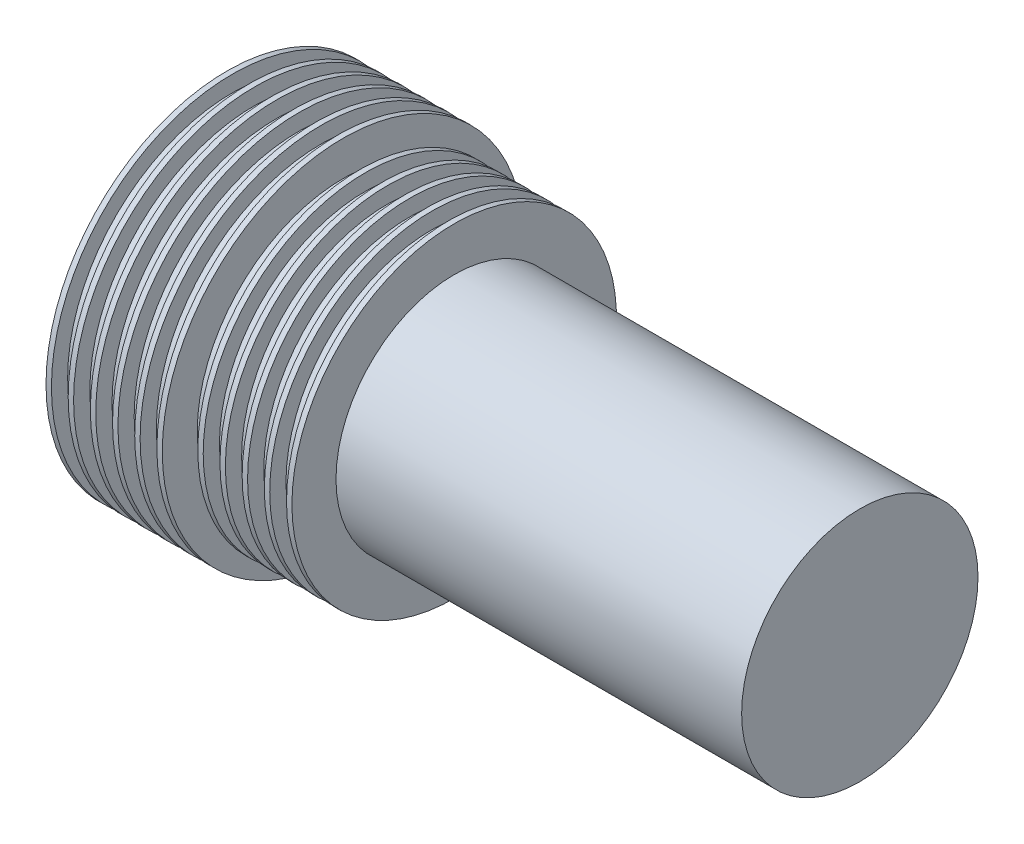
ISO-10303-21;
HEADER;
FILE_DESCRIPTION(('STEP AP214'),'2;1');
FILE_NAME('part.step','',(''),(''),'','','');
FILE_SCHEMA(('AUTOMOTIVE_DESIGN { 1 0 10303 214 1 1 1 1 }'));
ENDSEC;
DATA;
#1=APPLICATION_CONTEXT('core data for automotive mechanical design processes');
#2=APPLICATION_PROTOCOL_DEFINITION('international standard','automotive_design',2000,#1);
#3=PRODUCT_CONTEXT('',#1,'mechanical');
#4=PRODUCT('Part','Part','',(#3));
#5=PRODUCT_RELATED_PRODUCT_CATEGORY('part','',(#4));
#6=PRODUCT_DEFINITION_FORMATION('','',#4);
#7=PRODUCT_DEFINITION_CONTEXT('part definition',#1,'design');
#8=PRODUCT_DEFINITION('design','',#6,#7);
#9=PRODUCT_DEFINITION_SHAPE('','',#8);
#10=(LENGTH_UNIT() NAMED_UNIT(*) SI_UNIT(.MILLI.,.METRE.));
#11=(NAMED_UNIT(*) PLANE_ANGLE_UNIT() SI_UNIT($,.RADIAN.));
#12=(NAMED_UNIT(*) SI_UNIT($,.STERADIAN.) SOLID_ANGLE_UNIT());
#13=UNCERTAINTY_MEASURE_WITH_UNIT(LENGTH_MEASURE(1.E-05),#10,'distance_accuracy_value','');
#14=(GEOMETRIC_REPRESENTATION_CONTEXT(3) GLOBAL_UNCERTAINTY_ASSIGNED_CONTEXT((#13)) GLOBAL_UNIT_ASSIGNED_CONTEXT((#10,
#11,#12)) REPRESENTATION_CONTEXT('',''));
#15=CARTESIAN_POINT('',(0.,0.,0.));
#16=DIRECTION('',(0.,0.,1.));
#17=DIRECTION('',(1.,0.,0.));
#18=AXIS2_PLACEMENT_3D('',#15,#16,#17);
#19=CARTESIAN_POINT('',(0.,8.500000018,0.));
#20=DIRECTION('',(1.,0.,0.));
#21=DIRECTION('',(0.,0.,-1.));
#22=AXIS2_PLACEMENT_3D('',#19,#20,#21);
#23=PLANE('',#22);
#24=CARTESIAN_POINT('',(0.,0.,0.));
#25=DIRECTION('',(-1.,0.,0.));
#26=DIRECTION('',(0.,0.,1.));
#27=AXIS2_PLACEMENT_3D('',#24,#25,#26);
#28=CIRCLE('',#27,8.500000018);
#29=CARTESIAN_POINT('',(0.,0.,8.500000018));
#30=VERTEX_POINT('',#29);
#31=EDGE_CURVE('E183',#30,#30,#28,.T.);
#32=ORIENTED_EDGE('',*,*,#31,.T.);
#33=EDGE_LOOP('',(#32));
#34=FACE_BOUND('',#33,.T.);
#35=ADVANCED_FACE('F47',(#34),#23,.F.);
#36=CARTESIAN_POINT('',(29.718,0.,0.));
#37=DIRECTION('',(-1.,0.,0.));
#38=DIRECTION('',(0.,0.,1.));
#39=AXIS2_PLACEMENT_3D('',#36,#37,#38);
#40=PLANE('',#39);
#41=CARTESIAN_POINT('',(29.718,0.,0.));
#42=DIRECTION('',(-1.,0.,0.));
#43=DIRECTION('',(0.,0.,1.));
#44=AXIS2_PLACEMENT_3D('',#41,#42,#43);
#45=CIRCLE('',#44,5.5499);
#46=CARTESIAN_POINT('',(29.718,0.,5.5499));
#47=VERTEX_POINT('',#46);
#48=EDGE_CURVE('E10',#47,#47,#45,.T.);
#49=ORIENTED_EDGE('',*,*,#48,.F.);
#50=EDGE_LOOP('',(#49));
#51=FACE_BOUND('',#50,.T.);
#52=ADVANCED_FACE('F442',(#51),#40,.F.);
#53=CARTESIAN_POINT('',(0.,0.,0.));
#54=DIRECTION('',(-1.,0.,0.));
#55=DIRECTION('',(0.,0.,1.));
#56=AXIS2_PLACEMENT_3D('',#53,#54,#55);
#57=CYLINDRICAL_SURFACE('',#56,5.5499);
#58=CARTESIAN_POINT('',(10.668,0.,0.));
#59=DIRECTION('',(-1.,0.,0.));
#60=DIRECTION('',(0.,0.,1.));
#61=AXIS2_PLACEMENT_3D('',#58,#59,#60);
#62=CIRCLE('',#61,5.5499);
#63=CARTESIAN_POINT('',(10.668,0.,5.5499));
#64=VERTEX_POINT('',#63);
#65=EDGE_CURVE('E53',#64,#64,#62,.T.);
#66=ORIENTED_EDGE('',*,*,#65,.F.);
#67=EDGE_LOOP('',(#66));
#68=FACE_BOUND('',#67,.T.);
#69=ORIENTED_EDGE('',*,*,#48,.T.);
#70=EDGE_LOOP('',(#69));
#71=FACE_BOUND('',#70,.T.);
#72=ADVANCED_FACE('F436',(#68,#71),#57,.T.);
#73=CARTESIAN_POINT('',(10.668,7.62,0.));
#74=DIRECTION('',(-1.,0.,0.));
#75=DIRECTION('',(0.,0.,1.));
#76=AXIS2_PLACEMENT_3D('',#73,#74,#75);
#77=PLANE('',#76);
#78=CARTESIAN_POINT('',(10.668,0.,0.));
#79=DIRECTION('',(-1.,0.,0.));
#80=DIRECTION('',(0.,0.,1.));
#81=AXIS2_PLACEMENT_3D('',#78,#79,#80);
#82=CIRCLE('',#81,7.62);
#83=CARTESIAN_POINT('',(10.668,0.,7.62));
#84=VERTEX_POINT('',#83);
#85=EDGE_CURVE('E57',#84,#84,#82,.T.);
#86=ORIENTED_EDGE('',*,*,#85,.F.);
#87=EDGE_LOOP('',(#86));
#88=FACE_BOUND('',#87,.T.);
#89=ORIENTED_EDGE('',*,*,#65,.T.);
#90=EDGE_LOOP('',(#89));
#91=FACE_BOUND('',#90,.T.);
#92=ADVANCED_FACE('F431',(#88,#91),#77,.F.);
#93=CARTESIAN_POINT('',(0.,0.,0.));
#94=DIRECTION('',(-1.,0.,0.));
#95=DIRECTION('',(0.,0.,1.));
#96=AXIS2_PLACEMENT_3D('',#93,#94,#95);
#97=CYLINDRICAL_SURFACE('',#96,7.62);
#98=CARTESIAN_POINT('',(10.414,0.,0.));
#99=DIRECTION('',(-1.,0.,0.));
#100=DIRECTION('',(0.,0.,1.));
#101=AXIS2_PLACEMENT_3D('',#98,#99,#100);
#102=CIRCLE('',#101,7.62);
#103=CARTESIAN_POINT('',(10.414,0.,7.62));
#104=VERTEX_POINT('',#103);
#105=EDGE_CURVE('E61',#104,#104,#102,.T.);
#106=ORIENTED_EDGE('',*,*,#105,.F.);
#107=EDGE_LOOP('',(#106));
#108=FACE_BOUND('',#107,.T.);
#109=ORIENTED_EDGE('',*,*,#85,.T.);
#110=EDGE_LOOP('',(#109));
#111=FACE_BOUND('',#110,.T.);
#112=ADVANCED_FACE('F425',(#108,#111),#97,.T.);
#113=CARTESIAN_POINT('',(10.414,6.858,0.));
#114=DIRECTION('',(1.,0.,0.));
#115=DIRECTION('',(0.,0.,-1.));
#116=AXIS2_PLACEMENT_3D('',#113,#114,#115);
#117=PLANE('',#116);
#118=CARTESIAN_POINT('',(10.414,0.,0.));
#119=DIRECTION('',(-1.,0.,0.));
#120=DIRECTION('',(0.,0.,1.));
#121=AXIS2_PLACEMENT_3D('',#118,#119,#120);
#122=CIRCLE('',#121,6.858);
#123=CARTESIAN_POINT('',(10.414,0.,6.858));
#124=VERTEX_POINT('',#123);
#125=EDGE_CURVE('E66',#124,#124,#122,.T.);
#126=ORIENTED_EDGE('',*,*,#125,.F.);
#127=EDGE_LOOP('',(#126));
#128=FACE_BOUND('',#127,.T.);
#129=ORIENTED_EDGE('',*,*,#105,.T.);
#130=EDGE_LOOP('',(#129));
#131=FACE_BOUND('',#130,.T.);
#132=ADVANCED_FACE('F419',(#128,#131),#117,.F.);
#133=CARTESIAN_POINT('',(0.,0.,0.));
#134=DIRECTION('',(-1.,0.,0.));
#135=DIRECTION('',(0.,0.,1.));
#136=AXIS2_PLACEMENT_3D('',#133,#134,#135);
#137=CYLINDRICAL_SURFACE('',#136,6.858);
#138=CARTESIAN_POINT('',(9.6266,0.,0.));
#139=DIRECTION('',(-1.,0.,0.));
#140=DIRECTION('',(0.,0.,1.));
#141=AXIS2_PLACEMENT_3D('',#138,#139,#140);
#142=CIRCLE('',#141,6.858);
#143=CARTESIAN_POINT('',(9.6266,0.,6.858));
#144=VERTEX_POINT('',#143);
#145=EDGE_CURVE('E69',#144,#144,#142,.T.);
#146=ORIENTED_EDGE('',*,*,#145,.F.);
#147=EDGE_LOOP('',(#146));
#148=FACE_BOUND('',#147,.T.);
#149=ORIENTED_EDGE('',*,*,#125,.T.);
#150=EDGE_LOOP('',(#149));
#151=FACE_BOUND('',#150,.T.);
#152=ADVANCED_FACE('F413',(#148,#151),#137,.T.);
#153=CARTESIAN_POINT('',(9.6266,7.62,0.));
#154=DIRECTION('',(-1.,0.,0.));
#155=DIRECTION('',(0.,0.,1.));
#156=AXIS2_PLACEMENT_3D('',#153,#154,#155);
#157=PLANE('',#156);
#158=CARTESIAN_POINT('',(9.6266,0.,0.));
#159=DIRECTION('',(-1.,0.,0.));
#160=DIRECTION('',(0.,0.,1.));
#161=AXIS2_PLACEMENT_3D('',#158,#159,#160);
#162=CIRCLE('',#161,7.62);
#163=CARTESIAN_POINT('',(9.6266,0.,7.62));
#164=VERTEX_POINT('',#163);
#165=EDGE_CURVE('E72',#164,#164,#162,.T.);
#166=ORIENTED_EDGE('',*,*,#165,.F.);
#167=EDGE_LOOP('',(#166));
#168=FACE_BOUND('',#167,.T.);
#169=ORIENTED_EDGE('',*,*,#145,.T.);
#170=EDGE_LOOP('',(#169));
#171=FACE_BOUND('',#170,.T.);
#172=ADVANCED_FACE('F407',(#168,#171),#157,.F.);
#173=CARTESIAN_POINT('',(0.,0.,0.));
#174=DIRECTION('',(-1.,0.,0.));
#175=DIRECTION('',(0.,0.,1.));
#176=AXIS2_PLACEMENT_3D('',#173,#174,#175);
#177=CYLINDRICAL_SURFACE('',#176,7.62);
#178=CARTESIAN_POINT('',(9.3726,0.,0.));
#179=DIRECTION('',(-1.,0.,0.));
#180=DIRECTION('',(0.,0.,1.));
#181=AXIS2_PLACEMENT_3D('',#178,#179,#180);
#182=CIRCLE('',#181,7.62);
#183=CARTESIAN_POINT('',(9.3726,0.,7.62));
#184=VERTEX_POINT('',#183);
#185=EDGE_CURVE('E75',#184,#184,#182,.T.);
#186=ORIENTED_EDGE('',*,*,#185,.F.);
#187=EDGE_LOOP('',(#186));
#188=FACE_BOUND('',#187,.T.);
#189=ORIENTED_EDGE('',*,*,#165,.T.);
#190=EDGE_LOOP('',(#189));
#191=FACE_BOUND('',#190,.T.);
#192=ADVANCED_FACE('F401',(#188,#191),#177,.T.);
#193=CARTESIAN_POINT('',(9.3726,6.858,0.));
#194=DIRECTION('',(1.,0.,0.));
#195=DIRECTION('',(0.,0.,-1.));
#196=AXIS2_PLACEMENT_3D('',#193,#194,#195);
#197=PLANE('',#196);
#198=CARTESIAN_POINT('',(9.3726,0.,0.));
#199=DIRECTION('',(-1.,0.,0.));
#200=DIRECTION('',(0.,0.,1.));
#201=AXIS2_PLACEMENT_3D('',#198,#199,#200);
#202=CIRCLE('',#201,6.858);
#203=CARTESIAN_POINT('',(9.3726,0.,6.858));
#204=VERTEX_POINT('',#203);
#205=EDGE_CURVE('E78',#204,#204,#202,.T.);
#206=ORIENTED_EDGE('',*,*,#205,.F.);
#207=EDGE_LOOP('',(#206));
#208=FACE_BOUND('',#207,.T.);
#209=ORIENTED_EDGE('',*,*,#185,.T.);
#210=EDGE_LOOP('',(#209));
#211=FACE_BOUND('',#210,.T.);
#212=ADVANCED_FACE('F395',(#208,#211),#197,.F.);
#213=CARTESIAN_POINT('',(0.,0.,0.));
#214=DIRECTION('',(-1.,0.,0.));
#215=DIRECTION('',(0.,0.,1.));
#216=AXIS2_PLACEMENT_3D('',#213,#214,#215);
#217=CYLINDRICAL_SURFACE('',#216,6.858);
#218=CARTESIAN_POINT('',(8.5852,0.,0.));
#219=DIRECTION('',(-1.,0.,0.));
#220=DIRECTION('',(0.,0.,1.));
#221=AXIS2_PLACEMENT_3D('',#218,#219,#220);
#222=CIRCLE('',#221,6.858);
#223=CARTESIAN_POINT('',(8.5852,0.,6.858));
#224=VERTEX_POINT('',#223);
#225=EDGE_CURVE('E81',#224,#224,#222,.T.);
#226=ORIENTED_EDGE('',*,*,#225,.F.);
#227=EDGE_LOOP('',(#226));
#228=FACE_BOUND('',#227,.T.);
#229=ORIENTED_EDGE('',*,*,#205,.T.);
#230=EDGE_LOOP('',(#229));
#231=FACE_BOUND('',#230,.T.);
#232=ADVANCED_FACE('F389',(#228,#231),#217,.T.);
#233=CARTESIAN_POINT('',(8.5852,7.62,0.));
#234=DIRECTION('',(-1.,0.,0.));
#235=DIRECTION('',(0.,0.,1.));
#236=AXIS2_PLACEMENT_3D('',#233,#234,#235);
#237=PLANE('',#236);
#238=CARTESIAN_POINT('',(8.5852,0.,0.));
#239=DIRECTION('',(-1.,0.,0.));
#240=DIRECTION('',(0.,0.,1.));
#241=AXIS2_PLACEMENT_3D('',#238,#239,#240);
#242=CIRCLE('',#241,7.62);
#243=CARTESIAN_POINT('',(8.5852,0.,7.62));
#244=VERTEX_POINT('',#243);
#245=EDGE_CURVE('E84',#244,#244,#242,.T.);
#246=ORIENTED_EDGE('',*,*,#245,.F.);
#247=EDGE_LOOP('',(#246));
#248=FACE_BOUND('',#247,.T.);
#249=ORIENTED_EDGE('',*,*,#225,.T.);
#250=EDGE_LOOP('',(#249));
#251=FACE_BOUND('',#250,.T.);
#252=ADVANCED_FACE('F383',(#248,#251),#237,.F.);
#253=CARTESIAN_POINT('',(0.,0.,0.));
#254=DIRECTION('',(-1.,0.,0.));
#255=DIRECTION('',(0.,0.,1.));
#256=AXIS2_PLACEMENT_3D('',#253,#254,#255);
#257=CYLINDRICAL_SURFACE('',#256,7.62);
#258=CARTESIAN_POINT('',(8.3312,0.,0.));
#259=DIRECTION('',(-1.,0.,0.));
#260=DIRECTION('',(0.,0.,1.));
#261=AXIS2_PLACEMENT_3D('',#258,#259,#260);
#262=CIRCLE('',#261,7.62);
#263=CARTESIAN_POINT('',(8.3312,0.,7.62));
#264=VERTEX_POINT('',#263);
#265=EDGE_CURVE('E87',#264,#264,#262,.T.);
#266=ORIENTED_EDGE('',*,*,#265,.F.);
#267=EDGE_LOOP('',(#266));
#268=FACE_BOUND('',#267,.T.);
#269=ORIENTED_EDGE('',*,*,#245,.T.);
#270=EDGE_LOOP('',(#269));
#271=FACE_BOUND('',#270,.T.);
#272=ADVANCED_FACE('F377',(#268,#271),#257,.T.);
#273=CARTESIAN_POINT('',(8.3312,6.858,0.));
#274=DIRECTION('',(1.,0.,0.));
#275=DIRECTION('',(0.,0.,-1.));
#276=AXIS2_PLACEMENT_3D('',#273,#274,#275);
#277=PLANE('',#276);
#278=CARTESIAN_POINT('',(8.3312,0.,0.));
#279=DIRECTION('',(-1.,0.,0.));
#280=DIRECTION('',(0.,0.,1.));
#281=AXIS2_PLACEMENT_3D('',#278,#279,#280);
#282=CIRCLE('',#281,6.858);
#283=CARTESIAN_POINT('',(8.3312,0.,6.858));
#284=VERTEX_POINT('',#283);
#285=EDGE_CURVE('E90',#284,#284,#282,.T.);
#286=ORIENTED_EDGE('',*,*,#285,.F.);
#287=EDGE_LOOP('',(#286));
#288=FACE_BOUND('',#287,.T.);
#289=ORIENTED_EDGE('',*,*,#265,.T.);
#290=EDGE_LOOP('',(#289));
#291=FACE_BOUND('',#290,.T.);
#292=ADVANCED_FACE('F371',(#288,#291),#277,.F.);
#293=CARTESIAN_POINT('',(0.,0.,0.));
#294=DIRECTION('',(-1.,0.,0.));
#295=DIRECTION('',(0.,0.,1.));
#296=AXIS2_PLACEMENT_3D('',#293,#294,#295);
#297=CYLINDRICAL_SURFACE('',#296,6.858);
#298=CARTESIAN_POINT('',(7.5438,0.,0.));
#299=DIRECTION('',(-1.,0.,0.));
#300=DIRECTION('',(0.,0.,1.));
#301=AXIS2_PLACEMENT_3D('',#298,#299,#300);
#302=CIRCLE('',#301,6.858);
#303=CARTESIAN_POINT('',(7.5438,0.,6.858));
#304=VERTEX_POINT('',#303);
#305=EDGE_CURVE('E93',#304,#304,#302,.T.);
#306=ORIENTED_EDGE('',*,*,#305,.F.);
#307=EDGE_LOOP('',(#306));
#308=FACE_BOUND('',#307,.T.);
#309=ORIENTED_EDGE('',*,*,#285,.T.);
#310=EDGE_LOOP('',(#309));
#311=FACE_BOUND('',#310,.T.);
#312=ADVANCED_FACE('F365',(#308,#311),#297,.T.);
#313=CARTESIAN_POINT('',(7.5438,7.62,0.));
#314=DIRECTION('',(-1.,0.,0.));
#315=DIRECTION('',(0.,0.,1.));
#316=AXIS2_PLACEMENT_3D('',#313,#314,#315);
#317=PLANE('',#316);
#318=CARTESIAN_POINT('',(7.5438,0.,0.));
#319=DIRECTION('',(-1.,0.,0.));
#320=DIRECTION('',(0.,0.,1.));
#321=AXIS2_PLACEMENT_3D('',#318,#319,#320);
#322=CIRCLE('',#321,7.62);
#323=CARTESIAN_POINT('',(7.5438,0.,7.62));
#324=VERTEX_POINT('',#323);
#325=EDGE_CURVE('E96',#324,#324,#322,.T.);
#326=ORIENTED_EDGE('',*,*,#325,.F.);
#327=EDGE_LOOP('',(#326));
#328=FACE_BOUND('',#327,.T.);
#329=ORIENTED_EDGE('',*,*,#305,.T.);
#330=EDGE_LOOP('',(#329));
#331=FACE_BOUND('',#330,.T.);
#332=ADVANCED_FACE('F359',(#328,#331),#317,.F.);
#333=CARTESIAN_POINT('',(0.,0.,0.));
#334=DIRECTION('',(-1.,0.,0.));
#335=DIRECTION('',(0.,0.,1.));
#336=AXIS2_PLACEMENT_3D('',#333,#334,#335);
#337=CYLINDRICAL_SURFACE('',#336,7.62);
#338=CARTESIAN_POINT('',(7.2898,0.,0.));
#339=DIRECTION('',(-1.,0.,0.));
#340=DIRECTION('',(0.,0.,1.));
#341=AXIS2_PLACEMENT_3D('',#338,#339,#340);
#342=CIRCLE('',#341,7.62);
#343=CARTESIAN_POINT('',(7.2898,0.,7.62));
#344=VERTEX_POINT('',#343);
#345=EDGE_CURVE('E99',#344,#344,#342,.T.);
#346=ORIENTED_EDGE('',*,*,#345,.F.);
#347=EDGE_LOOP('',(#346));
#348=FACE_BOUND('',#347,.T.);
#349=ORIENTED_EDGE('',*,*,#325,.T.);
#350=EDGE_LOOP('',(#349));
#351=FACE_BOUND('',#350,.T.);
#352=ADVANCED_FACE('F353',(#348,#351),#337,.T.);
#353=CARTESIAN_POINT('',(7.2898,6.858,0.));
#354=DIRECTION('',(1.,0.,0.));
#355=DIRECTION('',(0.,0.,-1.));
#356=AXIS2_PLACEMENT_3D('',#353,#354,#355);
#357=PLANE('',#356);
#358=CARTESIAN_POINT('',(7.2898,0.,0.));
#359=DIRECTION('',(-1.,0.,0.));
#360=DIRECTION('',(0.,0.,1.));
#361=AXIS2_PLACEMENT_3D('',#358,#359,#360);
#362=CIRCLE('',#361,6.858);
#363=CARTESIAN_POINT('',(7.2898,0.,6.858));
#364=VERTEX_POINT('',#363);
#365=EDGE_CURVE('E102',#364,#364,#362,.T.);
#366=ORIENTED_EDGE('',*,*,#365,.F.);
#367=EDGE_LOOP('',(#366));
#368=FACE_BOUND('',#367,.T.);
#369=ORIENTED_EDGE('',*,*,#345,.T.);
#370=EDGE_LOOP('',(#369));
#371=FACE_BOUND('',#370,.T.);
#372=ADVANCED_FACE('F347',(#368,#371),#357,.F.);
#373=CARTESIAN_POINT('',(0.,0.,0.));
#374=DIRECTION('',(-1.,0.,0.));
#375=DIRECTION('',(0.,0.,1.));
#376=AXIS2_PLACEMENT_3D('',#373,#374,#375);
#377=CYLINDRICAL_SURFACE('',#376,6.858);
#378=CARTESIAN_POINT('',(6.5024,0.,0.));
#379=DIRECTION('',(-1.,0.,0.));
#380=DIRECTION('',(0.,0.,1.));
#381=AXIS2_PLACEMENT_3D('',#378,#379,#380);
#382=CIRCLE('',#381,6.858);
#383=CARTESIAN_POINT('',(6.5024,0.,6.858));
#384=VERTEX_POINT('',#383);
#385=EDGE_CURVE('E105',#384,#384,#382,.T.);
#386=ORIENTED_EDGE('',*,*,#385,.F.);
#387=EDGE_LOOP('',(#386));
#388=FACE_BOUND('',#387,.T.);
#389=ORIENTED_EDGE('',*,*,#365,.T.);
#390=EDGE_LOOP('',(#389));
#391=FACE_BOUND('',#390,.T.);
#392=ADVANCED_FACE('F341',(#388,#391),#377,.T.);
#393=CARTESIAN_POINT('',(6.5024,7.62,0.));
#394=DIRECTION('',(-1.,0.,0.));
#395=DIRECTION('',(0.,0.,1.));
#396=AXIS2_PLACEMENT_3D('',#393,#394,#395);
#397=PLANE('',#396);
#398=CARTESIAN_POINT('',(6.5024,0.,0.));
#399=DIRECTION('',(-1.,0.,0.));
#400=DIRECTION('',(0.,0.,1.));
#401=AXIS2_PLACEMENT_3D('',#398,#399,#400);
#402=CIRCLE('',#401,7.62);
#403=CARTESIAN_POINT('',(6.5024,0.,7.62));
#404=VERTEX_POINT('',#403);
#405=EDGE_CURVE('E108',#404,#404,#402,.T.);
#406=ORIENTED_EDGE('',*,*,#405,.F.);
#407=EDGE_LOOP('',(#406));
#408=FACE_BOUND('',#407,.T.);
#409=ORIENTED_EDGE('',*,*,#385,.T.);
#410=EDGE_LOOP('',(#409));
#411=FACE_BOUND('',#410,.T.);
#412=ADVANCED_FACE('F335',(#408,#411),#397,.F.);
#413=CARTESIAN_POINT('',(0.,0.,0.));
#414=DIRECTION('',(-1.,0.,0.));
#415=DIRECTION('',(0.,0.,1.));
#416=AXIS2_PLACEMENT_3D('',#413,#414,#415);
#417=CYLINDRICAL_SURFACE('',#416,7.62);
#418=CARTESIAN_POINT('',(6.2484,0.,0.));
#419=DIRECTION('',(-1.,0.,0.));
#420=DIRECTION('',(0.,0.,1.));
#421=AXIS2_PLACEMENT_3D('',#418,#419,#420);
#422=CIRCLE('',#421,7.62);
#423=CARTESIAN_POINT('',(6.2484,0.,7.62));
#424=VERTEX_POINT('',#423);
#425=EDGE_CURVE('E111',#424,#424,#422,.T.);
#426=ORIENTED_EDGE('',*,*,#425,.F.);
#427=EDGE_LOOP('',(#426));
#428=FACE_BOUND('',#427,.T.);
#429=ORIENTED_EDGE('',*,*,#405,.T.);
#430=EDGE_LOOP('',(#429));
#431=FACE_BOUND('',#430,.T.);
#432=ADVANCED_FACE('F329',(#428,#431),#417,.T.);
#433=CARTESIAN_POINT('',(6.2484,6.858,0.));
#434=DIRECTION('',(1.,0.,0.));
#435=DIRECTION('',(0.,0.,-1.));
#436=AXIS2_PLACEMENT_3D('',#433,#434,#435);
#437=PLANE('',#436);
#438=CARTESIAN_POINT('',(6.2484,0.,0.));
#439=DIRECTION('',(-1.,0.,0.));
#440=DIRECTION('',(0.,0.,1.));
#441=AXIS2_PLACEMENT_3D('',#438,#439,#440);
#442=CIRCLE('',#441,6.858);
#443=CARTESIAN_POINT('',(6.2484,0.,6.858));
#444=VERTEX_POINT('',#443);
#445=EDGE_CURVE('E114',#444,#444,#442,.T.);
#446=ORIENTED_EDGE('',*,*,#445,.F.);
#447=EDGE_LOOP('',(#446));
#448=FACE_BOUND('',#447,.T.);
#449=ORIENTED_EDGE('',*,*,#425,.T.);
#450=EDGE_LOOP('',(#449));
#451=FACE_BOUND('',#450,.T.);
#452=ADVANCED_FACE('F323',(#448,#451),#437,.F.);
#453=CARTESIAN_POINT('',(0.,0.,0.));
#454=DIRECTION('',(-1.,0.,0.));
#455=DIRECTION('',(0.,0.,1.));
#456=AXIS2_PLACEMENT_3D('',#453,#454,#455);
#457=CYLINDRICAL_SURFACE('',#456,6.858);
#458=CARTESIAN_POINT('',(5.461,0.,0.));
#459=DIRECTION('',(-1.,0.,0.));
#460=DIRECTION('',(0.,0.,1.));
#461=AXIS2_PLACEMENT_3D('',#458,#459,#460);
#462=CIRCLE('',#461,6.858);
#463=CARTESIAN_POINT('',(5.461,0.,6.858));
#464=VERTEX_POINT('',#463);
#465=EDGE_CURVE('E117',#464,#464,#462,.T.);
#466=ORIENTED_EDGE('',*,*,#465,.F.);
#467=EDGE_LOOP('',(#466));
#468=FACE_BOUND('',#467,.T.);
#469=ORIENTED_EDGE('',*,*,#445,.T.);
#470=EDGE_LOOP('',(#469));
#471=FACE_BOUND('',#470,.T.);
#472=ADVANCED_FACE('F317',(#468,#471),#457,.T.);
#473=CARTESIAN_POINT('',(5.461,7.62,0.));
#474=DIRECTION('',(-1.,0.,0.));
#475=DIRECTION('',(0.,0.,1.));
#476=AXIS2_PLACEMENT_3D('',#473,#474,#475);
#477=PLANE('',#476);
#478=CARTESIAN_POINT('',(5.461,0.,0.));
#479=DIRECTION('',(-1.,0.,0.));
#480=DIRECTION('',(0.,0.,1.));
#481=AXIS2_PLACEMENT_3D('',#478,#479,#480);
#482=CIRCLE('',#481,8.500000018);
#483=CARTESIAN_POINT('',(5.461,0.,8.500000018));
#484=VERTEX_POINT('',#483);
#485=EDGE_CURVE('E120',#484,#484,#482,.T.);
#486=ORIENTED_EDGE('',*,*,#485,.F.);
#487=EDGE_LOOP('',(#486));
#488=FACE_BOUND('',#487,.T.);
#489=ORIENTED_EDGE('',*,*,#465,.T.);
#490=EDGE_LOOP('',(#489));
#491=FACE_BOUND('',#490,.T.);
#492=ADVANCED_FACE('F311',(#488,#491),#477,.F.);
#493=CARTESIAN_POINT('',(0.,0.,0.));
#494=DIRECTION('',(-1.,0.,0.));
#495=DIRECTION('',(0.,0.,1.));
#496=AXIS2_PLACEMENT_3D('',#493,#494,#495);
#497=CYLINDRICAL_SURFACE('',#496,8.500000018);
#498=CARTESIAN_POINT('',(5.207,0.,0.));
#499=DIRECTION('',(-1.,0.,0.));
#500=DIRECTION('',(0.,0.,1.));
#501=AXIS2_PLACEMENT_3D('',#498,#499,#500);
#502=CIRCLE('',#501,8.500000018);
#503=CARTESIAN_POINT('',(5.207,0.,8.500000018));
#504=VERTEX_POINT('',#503);
#505=EDGE_CURVE('E123',#504,#504,#502,.T.);
#506=ORIENTED_EDGE('',*,*,#505,.F.);
#507=EDGE_LOOP('',(#506));
#508=FACE_BOUND('',#507,.T.);
#509=ORIENTED_EDGE('',*,*,#485,.T.);
#510=EDGE_LOOP('',(#509));
#511=FACE_BOUND('',#510,.T.);
#512=ADVANCED_FACE('F305',(#508,#511),#497,.T.);
#513=CARTESIAN_POINT('',(5.207,7.738000018,0.));
#514=DIRECTION('',(1.,0.,0.));
#515=DIRECTION('',(0.,0.,-1.));
#516=AXIS2_PLACEMENT_3D('',#513,#514,#515);
#517=PLANE('',#516);
#518=CARTESIAN_POINT('',(5.207,0.,0.));
#519=DIRECTION('',(-1.,0.,0.));
#520=DIRECTION('',(0.,0.,1.));
#521=AXIS2_PLACEMENT_3D('',#518,#519,#520);
#522=CIRCLE('',#521,7.738000018);
#523=CARTESIAN_POINT('',(5.207,0.,7.738000018));
#524=VERTEX_POINT('',#523);
#525=EDGE_CURVE('E126',#524,#524,#522,.T.);
#526=ORIENTED_EDGE('',*,*,#525,.F.);
#527=EDGE_LOOP('',(#526));
#528=FACE_BOUND('',#527,.T.);
#529=ORIENTED_EDGE('',*,*,#505,.T.);
#530=EDGE_LOOP('',(#529));
#531=FACE_BOUND('',#530,.T.);
#532=ADVANCED_FACE('F299',(#528,#531),#517,.F.);
#533=CARTESIAN_POINT('',(0.,0.,0.));
#534=DIRECTION('',(-1.,0.,0.));
#535=DIRECTION('',(0.,0.,1.));
#536=AXIS2_PLACEMENT_3D('',#533,#534,#535);
#537=CYLINDRICAL_SURFACE('',#536,7.738000018);
#538=CARTESIAN_POINT('',(4.4196,0.,0.));
#539=DIRECTION('',(-1.,0.,0.));
#540=DIRECTION('',(0.,0.,1.));
#541=AXIS2_PLACEMENT_3D('',#538,#539,#540);
#542=CIRCLE('',#541,7.738000018);
#543=CARTESIAN_POINT('',(4.4196,0.,7.738000018));
#544=VERTEX_POINT('',#543);
#545=EDGE_CURVE('E129',#544,#544,#542,.T.);
#546=ORIENTED_EDGE('',*,*,#545,.F.);
#547=EDGE_LOOP('',(#546));
#548=FACE_BOUND('',#547,.T.);
#549=ORIENTED_EDGE('',*,*,#525,.T.);
#550=EDGE_LOOP('',(#549));
#551=FACE_BOUND('',#550,.T.);
#552=ADVANCED_FACE('F293',(#548,#551),#537,.T.);
#553=CARTESIAN_POINT('',(4.4196,8.500000018,0.));
#554=DIRECTION('',(-1.,0.,0.));
#555=DIRECTION('',(0.,0.,1.));
#556=AXIS2_PLACEMENT_3D('',#553,#554,#555);
#557=PLANE('',#556);
#558=CARTESIAN_POINT('',(4.4196,0.,0.));
#559=DIRECTION('',(-1.,0.,0.));
#560=DIRECTION('',(0.,0.,1.));
#561=AXIS2_PLACEMENT_3D('',#558,#559,#560);
#562=CIRCLE('',#561,8.500000018);
#563=CARTESIAN_POINT('',(4.4196,0.,8.500000018));
#564=VERTEX_POINT('',#563);
#565=EDGE_CURVE('E132',#564,#564,#562,.T.);
#566=ORIENTED_EDGE('',*,*,#565,.F.);
#567=EDGE_LOOP('',(#566));
#568=FACE_BOUND('',#567,.T.);
#569=ORIENTED_EDGE('',*,*,#545,.T.);
#570=EDGE_LOOP('',(#569));
#571=FACE_BOUND('',#570,.T.);
#572=ADVANCED_FACE('F287',(#568,#571),#557,.F.);
#573=CARTESIAN_POINT('',(0.,0.,0.));
#574=DIRECTION('',(-1.,0.,0.));
#575=DIRECTION('',(0.,0.,1.));
#576=AXIS2_PLACEMENT_3D('',#573,#574,#575);
#577=CYLINDRICAL_SURFACE('',#576,8.500000018);
#578=CARTESIAN_POINT('',(4.1656,0.,0.));
#579=DIRECTION('',(-1.,0.,0.));
#580=DIRECTION('',(0.,0.,1.));
#581=AXIS2_PLACEMENT_3D('',#578,#579,#580);
#582=CIRCLE('',#581,8.500000018);
#583=CARTESIAN_POINT('',(4.1656,0.,8.500000018));
#584=VERTEX_POINT('',#583);
#585=EDGE_CURVE('E135',#584,#584,#582,.T.);
#586=ORIENTED_EDGE('',*,*,#585,.F.);
#587=EDGE_LOOP('',(#586));
#588=FACE_BOUND('',#587,.T.);
#589=ORIENTED_EDGE('',*,*,#565,.T.);
#590=EDGE_LOOP('',(#589));
#591=FACE_BOUND('',#590,.T.);
#592=ADVANCED_FACE('F281',(#588,#591),#577,.T.);
#593=CARTESIAN_POINT('',(4.1656,7.738000018,0.));
#594=DIRECTION('',(1.,0.,0.));
#595=DIRECTION('',(0.,0.,-1.));
#596=AXIS2_PLACEMENT_3D('',#593,#594,#595);
#597=PLANE('',#596);
#598=CARTESIAN_POINT('',(4.1656,0.,0.));
#599=DIRECTION('',(-1.,0.,0.));
#600=DIRECTION('',(0.,0.,1.));
#601=AXIS2_PLACEMENT_3D('',#598,#599,#600);
#602=CIRCLE('',#601,7.738000018);
#603=CARTESIAN_POINT('',(4.1656,0.,7.738000018));
#604=VERTEX_POINT('',#603);
#605=EDGE_CURVE('E138',#604,#604,#602,.T.);
#606=ORIENTED_EDGE('',*,*,#605,.F.);
#607=EDGE_LOOP('',(#606));
#608=FACE_BOUND('',#607,.T.);
#609=ORIENTED_EDGE('',*,*,#585,.T.);
#610=EDGE_LOOP('',(#609));
#611=FACE_BOUND('',#610,.T.);
#612=ADVANCED_FACE('F275',(#608,#611),#597,.F.);
#613=CARTESIAN_POINT('',(0.,0.,0.));
#614=DIRECTION('',(-1.,0.,0.));
#615=DIRECTION('',(0.,0.,1.));
#616=AXIS2_PLACEMENT_3D('',#613,#614,#615);
#617=CYLINDRICAL_SURFACE('',#616,7.738000018);
#618=CARTESIAN_POINT('',(3.3782,0.,0.));
#619=DIRECTION('',(-1.,0.,0.));
#620=DIRECTION('',(0.,0.,1.));
#621=AXIS2_PLACEMENT_3D('',#618,#619,#620);
#622=CIRCLE('',#621,7.738000018);
#623=CARTESIAN_POINT('',(3.3782,0.,7.738000018));
#624=VERTEX_POINT('',#623);
#625=EDGE_CURVE('E141',#624,#624,#622,.T.);
#626=ORIENTED_EDGE('',*,*,#625,.F.);
#627=EDGE_LOOP('',(#626));
#628=FACE_BOUND('',#627,.T.);
#629=ORIENTED_EDGE('',*,*,#605,.T.);
#630=EDGE_LOOP('',(#629));
#631=FACE_BOUND('',#630,.T.);
#632=ADVANCED_FACE('F269',(#628,#631),#617,.T.);
#633=CARTESIAN_POINT('',(3.3782,8.500000018,0.));
#634=DIRECTION('',(-1.,0.,0.));
#635=DIRECTION('',(0.,0.,1.));
#636=AXIS2_PLACEMENT_3D('',#633,#634,#635);
#637=PLANE('',#636);
#638=CARTESIAN_POINT('',(3.3782,0.,0.));
#639=DIRECTION('',(-1.,0.,0.));
#640=DIRECTION('',(0.,0.,1.));
#641=AXIS2_PLACEMENT_3D('',#638,#639,#640);
#642=CIRCLE('',#641,8.500000018);
#643=CARTESIAN_POINT('',(3.3782,0.,8.500000018));
#644=VERTEX_POINT('',#643);
#645=EDGE_CURVE('E144',#644,#644,#642,.T.);
#646=ORIENTED_EDGE('',*,*,#645,.F.);
#647=EDGE_LOOP('',(#646));
#648=FACE_BOUND('',#647,.T.);
#649=ORIENTED_EDGE('',*,*,#625,.T.);
#650=EDGE_LOOP('',(#649));
#651=FACE_BOUND('',#650,.T.);
#652=ADVANCED_FACE('F263',(#648,#651),#637,.F.);
#653=CARTESIAN_POINT('',(0.,0.,0.));
#654=DIRECTION('',(-1.,0.,0.));
#655=DIRECTION('',(0.,0.,1.));
#656=AXIS2_PLACEMENT_3D('',#653,#654,#655);
#657=CYLINDRICAL_SURFACE('',#656,8.500000018);
#658=CARTESIAN_POINT('',(3.1242,0.,0.));
#659=DIRECTION('',(-1.,0.,0.));
#660=DIRECTION('',(0.,0.,1.));
#661=AXIS2_PLACEMENT_3D('',#658,#659,#660);
#662=CIRCLE('',#661,8.500000018);
#663=CARTESIAN_POINT('',(3.1242,0.,8.500000018));
#664=VERTEX_POINT('',#663);
#665=EDGE_CURVE('E147',#664,#664,#662,.T.);
#666=ORIENTED_EDGE('',*,*,#665,.F.);
#667=EDGE_LOOP('',(#666));
#668=FACE_BOUND('',#667,.T.);
#669=ORIENTED_EDGE('',*,*,#645,.T.);
#670=EDGE_LOOP('',(#669));
#671=FACE_BOUND('',#670,.T.);
#672=ADVANCED_FACE('F257',(#668,#671),#657,.T.);
#673=CARTESIAN_POINT('',(3.1242,7.738000018,0.));
#674=DIRECTION('',(1.,0.,0.));
#675=DIRECTION('',(0.,0.,-1.));
#676=AXIS2_PLACEMENT_3D('',#673,#674,#675);
#677=PLANE('',#676);
#678=CARTESIAN_POINT('',(3.1242,0.,0.));
#679=DIRECTION('',(-1.,0.,0.));
#680=DIRECTION('',(0.,0.,1.));
#681=AXIS2_PLACEMENT_3D('',#678,#679,#680);
#682=CIRCLE('',#681,7.738000018);
#683=CARTESIAN_POINT('',(3.1242,0.,7.738000018));
#684=VERTEX_POINT('',#683);
#685=EDGE_CURVE('E150',#684,#684,#682,.T.);
#686=ORIENTED_EDGE('',*,*,#685,.F.);
#687=EDGE_LOOP('',(#686));
#688=FACE_BOUND('',#687,.T.);
#689=ORIENTED_EDGE('',*,*,#665,.T.);
#690=EDGE_LOOP('',(#689));
#691=FACE_BOUND('',#690,.T.);
#692=ADVANCED_FACE('F251',(#688,#691),#677,.F.);
#693=CARTESIAN_POINT('',(0.,0.,0.));
#694=DIRECTION('',(-1.,0.,0.));
#695=DIRECTION('',(0.,0.,1.));
#696=AXIS2_PLACEMENT_3D('',#693,#694,#695);
#697=CYLINDRICAL_SURFACE('',#696,7.738000018);
#698=CARTESIAN_POINT('',(2.3368,0.,0.));
#699=DIRECTION('',(-1.,0.,0.));
#700=DIRECTION('',(0.,0.,1.));
#701=AXIS2_PLACEMENT_3D('',#698,#699,#700);
#702=CIRCLE('',#701,7.738000018);
#703=CARTESIAN_POINT('',(2.3368,0.,7.738000018));
#704=VERTEX_POINT('',#703);
#705=EDGE_CURVE('E153',#704,#704,#702,.T.);
#706=ORIENTED_EDGE('',*,*,#705,.F.);
#707=EDGE_LOOP('',(#706));
#708=FACE_BOUND('',#707,.T.);
#709=ORIENTED_EDGE('',*,*,#685,.T.);
#710=EDGE_LOOP('',(#709));
#711=FACE_BOUND('',#710,.T.);
#712=ADVANCED_FACE('F245',(#708,#711),#697,.T.);
#713=CARTESIAN_POINT('',(2.3368,8.500000018,0.));
#714=DIRECTION('',(-1.,0.,0.));
#715=DIRECTION('',(0.,0.,1.));
#716=AXIS2_PLACEMENT_3D('',#713,#714,#715);
#717=PLANE('',#716);
#718=CARTESIAN_POINT('',(2.3368,0.,0.));
#719=DIRECTION('',(-1.,0.,0.));
#720=DIRECTION('',(0.,0.,1.));
#721=AXIS2_PLACEMENT_3D('',#718,#719,#720);
#722=CIRCLE('',#721,8.500000018);
#723=CARTESIAN_POINT('',(2.3368,0.,8.500000018));
#724=VERTEX_POINT('',#723);
#725=EDGE_CURVE('E156',#724,#724,#722,.T.);
#726=ORIENTED_EDGE('',*,*,#725,.F.);
#727=EDGE_LOOP('',(#726));
#728=FACE_BOUND('',#727,.T.);
#729=ORIENTED_EDGE('',*,*,#705,.T.);
#730=EDGE_LOOP('',(#729));
#731=FACE_BOUND('',#730,.T.);
#732=ADVANCED_FACE('F239',(#728,#731),#717,.F.);
#733=CARTESIAN_POINT('',(0.,0.,0.));
#734=DIRECTION('',(-1.,0.,0.));
#735=DIRECTION('',(0.,0.,1.));
#736=AXIS2_PLACEMENT_3D('',#733,#734,#735);
#737=CYLINDRICAL_SURFACE('',#736,8.500000018);
#738=CARTESIAN_POINT('',(2.0828,0.,0.));
#739=DIRECTION('',(-1.,0.,0.));
#740=DIRECTION('',(0.,0.,1.));
#741=AXIS2_PLACEMENT_3D('',#738,#739,#740);
#742=CIRCLE('',#741,8.500000018);
#743=CARTESIAN_POINT('',(2.0828,0.,8.500000018));
#744=VERTEX_POINT('',#743);
#745=EDGE_CURVE('E159',#744,#744,#742,.T.);
#746=ORIENTED_EDGE('',*,*,#745,.F.);
#747=EDGE_LOOP('',(#746));
#748=FACE_BOUND('',#747,.T.);
#749=ORIENTED_EDGE('',*,*,#725,.T.);
#750=EDGE_LOOP('',(#749));
#751=FACE_BOUND('',#750,.T.);
#752=ADVANCED_FACE('F233',(#748,#751),#737,.T.);
#753=CARTESIAN_POINT('',(2.0828,7.738000018,0.));
#754=DIRECTION('',(1.,0.,0.));
#755=DIRECTION('',(0.,0.,-1.));
#756=AXIS2_PLACEMENT_3D('',#753,#754,#755);
#757=PLANE('',#756);
#758=CARTESIAN_POINT('',(2.0828,0.,0.));
#759=DIRECTION('',(-1.,0.,0.));
#760=DIRECTION('',(0.,0.,1.));
#761=AXIS2_PLACEMENT_3D('',#758,#759,#760);
#762=CIRCLE('',#761,7.738000018);
#763=CARTESIAN_POINT('',(2.0828,0.,7.738000018));
#764=VERTEX_POINT('',#763);
#765=EDGE_CURVE('E162',#764,#764,#762,.T.);
#766=ORIENTED_EDGE('',*,*,#765,.F.);
#767=EDGE_LOOP('',(#766));
#768=FACE_BOUND('',#767,.T.);
#769=ORIENTED_EDGE('',*,*,#745,.T.);
#770=EDGE_LOOP('',(#769));
#771=FACE_BOUND('',#770,.T.);
#772=ADVANCED_FACE('F227',(#768,#771),#757,.F.);
#773=CARTESIAN_POINT('',(0.,0.,0.));
#774=DIRECTION('',(-1.,0.,0.));
#775=DIRECTION('',(0.,0.,1.));
#776=AXIS2_PLACEMENT_3D('',#773,#774,#775);
#777=CYLINDRICAL_SURFACE('',#776,7.738000018);
#778=CARTESIAN_POINT('',(1.2954,0.,0.));
#779=DIRECTION('',(-1.,0.,0.));
#780=DIRECTION('',(0.,0.,1.));
#781=AXIS2_PLACEMENT_3D('',#778,#779,#780);
#782=CIRCLE('',#781,7.738000018);
#783=CARTESIAN_POINT('',(1.2954,0.,7.738000018));
#784=VERTEX_POINT('',#783);
#785=EDGE_CURVE('E165',#784,#784,#782,.T.);
#786=ORIENTED_EDGE('',*,*,#785,.F.);
#787=EDGE_LOOP('',(#786));
#788=FACE_BOUND('',#787,.T.);
#789=ORIENTED_EDGE('',*,*,#765,.T.);
#790=EDGE_LOOP('',(#789));
#791=FACE_BOUND('',#790,.T.);
#792=ADVANCED_FACE('F221',(#788,#791),#777,.T.);
#793=CARTESIAN_POINT('',(1.2954,8.500000018,0.));
#794=DIRECTION('',(-1.,0.,0.));
#795=DIRECTION('',(0.,0.,1.));
#796=AXIS2_PLACEMENT_3D('',#793,#794,#795);
#797=PLANE('',#796);
#798=CARTESIAN_POINT('',(1.2954,0.,0.));
#799=DIRECTION('',(-1.,0.,0.));
#800=DIRECTION('',(0.,0.,1.));
#801=AXIS2_PLACEMENT_3D('',#798,#799,#800);
#802=CIRCLE('',#801,8.500000018);
#803=CARTESIAN_POINT('',(1.2954,0.,8.500000018));
#804=VERTEX_POINT('',#803);
#805=EDGE_CURVE('E168',#804,#804,#802,.T.);
#806=ORIENTED_EDGE('',*,*,#805,.F.);
#807=EDGE_LOOP('',(#806));
#808=FACE_BOUND('',#807,.T.);
#809=ORIENTED_EDGE('',*,*,#785,.T.);
#810=EDGE_LOOP('',(#809));
#811=FACE_BOUND('',#810,.T.);
#812=ADVANCED_FACE('F215',(#808,#811),#797,.F.);
#813=CARTESIAN_POINT('',(0.,0.,0.));
#814=DIRECTION('',(-1.,0.,0.));
#815=DIRECTION('',(0.,0.,1.));
#816=AXIS2_PLACEMENT_3D('',#813,#814,#815);
#817=CYLINDRICAL_SURFACE('',#816,8.500000018);
#818=CARTESIAN_POINT('',(1.0414,0.,0.));
#819=DIRECTION('',(-1.,0.,0.));
#820=DIRECTION('',(0.,0.,1.));
#821=AXIS2_PLACEMENT_3D('',#818,#819,#820);
#822=CIRCLE('',#821,8.500000018);
#823=CARTESIAN_POINT('',(1.0414,0.,8.500000018));
#824=VERTEX_POINT('',#823);
#825=EDGE_CURVE('E171',#824,#824,#822,.T.);
#826=ORIENTED_EDGE('',*,*,#825,.F.);
#827=EDGE_LOOP('',(#826));
#828=FACE_BOUND('',#827,.T.);
#829=ORIENTED_EDGE('',*,*,#805,.T.);
#830=EDGE_LOOP('',(#829));
#831=FACE_BOUND('',#830,.T.);
#832=ADVANCED_FACE('F209',(#828,#831),#817,.T.);
#833=CARTESIAN_POINT('',(1.0414,7.738000018,0.));
#834=DIRECTION('',(1.,0.,0.));
#835=DIRECTION('',(0.,0.,-1.));
#836=AXIS2_PLACEMENT_3D('',#833,#834,#835);
#837=PLANE('',#836);
#838=CARTESIAN_POINT('',(1.0414,0.,0.));
#839=DIRECTION('',(-1.,0.,0.));
#840=DIRECTION('',(0.,0.,1.));
#841=AXIS2_PLACEMENT_3D('',#838,#839,#840);
#842=CIRCLE('',#841,7.738000018);
#843=CARTESIAN_POINT('',(1.0414,0.,7.738000018));
#844=VERTEX_POINT('',#843);
#845=EDGE_CURVE('E174',#844,#844,#842,.T.);
#846=ORIENTED_EDGE('',*,*,#845,.F.);
#847=EDGE_LOOP('',(#846));
#848=FACE_BOUND('',#847,.T.);
#849=ORIENTED_EDGE('',*,*,#825,.T.);
#850=EDGE_LOOP('',(#849));
#851=FACE_BOUND('',#850,.T.);
#852=ADVANCED_FACE('F203',(#848,#851),#837,.F.);
#853=CARTESIAN_POINT('',(0.,0.,0.));
#854=DIRECTION('',(-1.,0.,0.));
#855=DIRECTION('',(0.,0.,1.));
#856=AXIS2_PLACEMENT_3D('',#853,#854,#855);
#857=CYLINDRICAL_SURFACE('',#856,7.738000018);
#858=CARTESIAN_POINT('',(0.254,0.,0.));
#859=DIRECTION('',(-1.,0.,0.));
#860=DIRECTION('',(0.,0.,1.));
#861=AXIS2_PLACEMENT_3D('',#858,#859,#860);
#862=CIRCLE('',#861,7.738000018);
#863=CARTESIAN_POINT('',(0.254,0.,7.738000018));
#864=VERTEX_POINT('',#863);
#865=EDGE_CURVE('E177',#864,#864,#862,.T.);
#866=ORIENTED_EDGE('',*,*,#865,.F.);
#867=EDGE_LOOP('',(#866));
#868=FACE_BOUND('',#867,.T.);
#869=ORIENTED_EDGE('',*,*,#845,.T.);
#870=EDGE_LOOP('',(#869));
#871=FACE_BOUND('',#870,.T.);
#872=ADVANCED_FACE('F197',(#868,#871),#857,.T.);
#873=CARTESIAN_POINT('',(0.254,8.500000018,0.));
#874=DIRECTION('',(-1.,0.,0.));
#875=DIRECTION('',(0.,0.,1.));
#876=AXIS2_PLACEMENT_3D('',#873,#874,#875);
#877=PLANE('',#876);
#878=CARTESIAN_POINT('',(0.254,0.,0.));
#879=DIRECTION('',(-1.,0.,0.));
#880=DIRECTION('',(0.,0.,1.));
#881=AXIS2_PLACEMENT_3D('',#878,#879,#880);
#882=CIRCLE('',#881,8.500000018);
#883=CARTESIAN_POINT('',(0.254,0.,8.500000018));
#884=VERTEX_POINT('',#883);
#885=EDGE_CURVE('E180',#884,#884,#882,.T.);
#886=ORIENTED_EDGE('',*,*,#885,.F.);
#887=EDGE_LOOP('',(#886));
#888=FACE_BOUND('',#887,.T.);
#889=ORIENTED_EDGE('',*,*,#865,.T.);
#890=EDGE_LOOP('',(#889));
#891=FACE_BOUND('',#890,.T.);
#892=ADVANCED_FACE('F191',(#888,#891),#877,.F.);
#893=CARTESIAN_POINT('',(0.,0.,0.));
#894=DIRECTION('',(-1.,0.,0.));
#895=DIRECTION('',(0.,0.,1.));
#896=AXIS2_PLACEMENT_3D('',#893,#894,#895);
#897=CYLINDRICAL_SURFACE('',#896,8.500000018);
#898=ORIENTED_EDGE('',*,*,#31,.F.);
#899=EDGE_LOOP('',(#898));
#900=FACE_BOUND('',#899,.T.);
#901=ORIENTED_EDGE('',*,*,#885,.T.);
#902=EDGE_LOOP('',(#901));
#903=FACE_BOUND('',#902,.T.);
#904=ADVANCED_FACE('F188',(#900,#903),#897,.T.);
#905=CLOSED_SHELL('',(#35,#52,#72,#92,#112,#132,#152,#172,#192,#212,#232,#252,#272,#292,#312,
#332,#352,#372,#392,#412,#432,#452,#472,#492,#512,#532,#552,#572,#592,#612,#632,#652,#672,#692,
#712,#732,#752,#772,#792,#812,#832,#852,#872,#892,#904));
#906=MANIFOLD_SOLID_BREP('B2',#905);
#907=ADVANCED_BREP_SHAPE_REPRESENTATION('',(#18,#906),#14);
#908=SHAPE_DEFINITION_REPRESENTATION(#9,#907);
ENDSEC;
END-ISO-10303-21;
